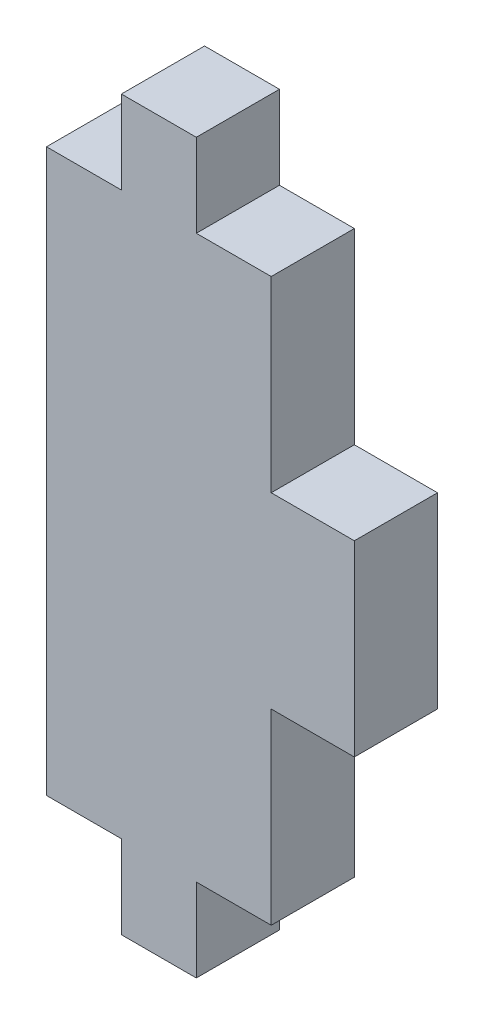
ISO-10303-21;
HEADER;
FILE_DESCRIPTION(('STEP AP214'),'2;1');
FILE_NAME('part.step','',(''),(''),'','','');
FILE_SCHEMA(('AUTOMOTIVE_DESIGN { 1 0 10303 214 1 1 1 1 }'));
ENDSEC;
DATA;
#1=APPLICATION_CONTEXT('core data for automotive mechanical design processes');
#2=APPLICATION_PROTOCOL_DEFINITION('international standard','automotive_design',2000,#1);
#3=PRODUCT_CONTEXT('',#1,'mechanical');
#4=PRODUCT('Part','Part','',(#3));
#5=PRODUCT_RELATED_PRODUCT_CATEGORY('part','',(#4));
#6=PRODUCT_DEFINITION_FORMATION('','',#4);
#7=PRODUCT_DEFINITION_CONTEXT('part definition',#1,'design');
#8=PRODUCT_DEFINITION('design','',#6,#7);
#9=PRODUCT_DEFINITION_SHAPE('','',#8);
#10=(LENGTH_UNIT() NAMED_UNIT(*) SI_UNIT(.MILLI.,.METRE.));
#11=(NAMED_UNIT(*) PLANE_ANGLE_UNIT() SI_UNIT($,.RADIAN.));
#12=(NAMED_UNIT(*) SI_UNIT($,.STERADIAN.) SOLID_ANGLE_UNIT());
#13=UNCERTAINTY_MEASURE_WITH_UNIT(LENGTH_MEASURE(1.E-05),#10,'distance_accuracy_value','');
#14=(GEOMETRIC_REPRESENTATION_CONTEXT(3) GLOBAL_UNCERTAINTY_ASSIGNED_CONTEXT((#13)) GLOBAL_UNIT_ASSIGNED_CONTEXT((#10,
#11,#12)) REPRESENTATION_CONTEXT('',''));
#15=CARTESIAN_POINT('',(0.,0.,0.));
#16=DIRECTION('',(0.,0.,1.));
#17=DIRECTION('',(1.,0.,0.));
#18=AXIS2_PLACEMENT_3D('',#15,#16,#17);
#19=CARTESIAN_POINT('',(0.,0.,4.699));
#20=DIRECTION('',(1.,0.,0.));
#21=DIRECTION('',(0.,0.,-1.));
#22=AXIS2_PLACEMENT_3D('',#19,#20,#21);
#23=PLANE('',#22);
#24=DIRECTION('',(0.,-1.,0.));
#25=VECTOR('',#24,1.);
#26=CARTESIAN_POINT('',(0.,0.,0.));
#27=LINE('',#26,#25);
#28=CARTESIAN_POINT('',(0.,31.75,0.));
#29=VERTEX_POINT('',#28);
#30=CARTESIAN_POINT('',(0.,0.,0.));
#31=VERTEX_POINT('',#30);
#32=EDGE_CURVE('E177',#29,#31,#27,.T.);
#33=ORIENTED_EDGE('',*,*,#32,.T.);
#34=DIRECTION('',(0.,0.,-1.));
#35=VECTOR('',#34,1.);
#36=CARTESIAN_POINT('',(0.,0.,4.699));
#37=LINE('',#36,#35);
#38=CARTESIAN_POINT('',(0.,0.,4.699));
#39=VERTEX_POINT('',#38);
#40=EDGE_CURVE('E11',#39,#31,#37,.T.);
#41=ORIENTED_EDGE('',*,*,#40,.F.);
#42=DIRECTION('',(0.,-1.,0.));
#43=VECTOR('',#42,1.);
#44=CARTESIAN_POINT('',(0.,0.,4.699));
#45=LINE('',#44,#43);
#46=CARTESIAN_POINT('',(0.,31.75,4.699));
#47=VERTEX_POINT('',#46);
#48=EDGE_CURVE('E207',#47,#39,#45,.T.);
#49=ORIENTED_EDGE('',*,*,#48,.F.);
#50=DIRECTION('',(0.,0.,-1.));
#51=VECTOR('',#50,1.);
#52=CARTESIAN_POINT('',(0.,31.75,4.699));
#53=LINE('',#52,#51);
#54=EDGE_CURVE('E173',#47,#29,#53,.T.);
#55=ORIENTED_EDGE('',*,*,#54,.T.);
#56=EDGE_LOOP('',(#33,#41,#49,#55));
#57=FACE_BOUND('',#56,.T.);
#58=ADVANCED_FACE('F33',(#57),#23,.F.);
#59=CARTESIAN_POINT('',(0.,0.,4.699));
#60=DIRECTION('',(0.,1.,0.));
#61=DIRECTION('',(0.,0.,1.));
#62=AXIS2_PLACEMENT_3D('',#59,#60,#61);
#63=PLANE('',#62);
#64=DIRECTION('',(1.,0.,0.));
#65=VECTOR('',#64,1.);
#66=CARTESIAN_POINT('',(0.,0.,0.));
#67=LINE('',#66,#65);
#68=CARTESIAN_POINT('',(4.23333333333334,0.,0.));
#69=VERTEX_POINT('',#68);
#70=EDGE_CURVE('E180',#31,#69,#67,.T.);
#71=ORIENTED_EDGE('',*,*,#70,.T.);
#72=DIRECTION('',(0.,0.,-1.));
#73=VECTOR('',#72,1.);
#74=CARTESIAN_POINT('',(4.23333333333334,0.,4.699));
#75=LINE('',#74,#73);
#76=CARTESIAN_POINT('',(4.23333333333334,0.,4.699));
#77=VERTEX_POINT('',#76);
#78=EDGE_CURVE('E41',#77,#69,#75,.T.);
#79=ORIENTED_EDGE('',*,*,#78,.F.);
#80=DIRECTION('',(1.,0.,0.));
#81=VECTOR('',#80,1.);
#82=CARTESIAN_POINT('',(0.,0.,4.699));
#83=LINE('',#82,#81);
#84=EDGE_CURVE('E116',#39,#77,#83,.T.);
#85=ORIENTED_EDGE('',*,*,#84,.F.);
#86=ORIENTED_EDGE('',*,*,#40,.T.);
#87=EDGE_LOOP('',(#71,#79,#85,#86));
#88=FACE_BOUND('',#87,.T.);
#89=ADVANCED_FACE('F305',(#88),#63,.F.);
#90=CARTESIAN_POINT('',(4.23333333333334,0.,4.699));
#91=DIRECTION('',(1.,0.,0.));
#92=DIRECTION('',(0.,1.,0.));
#93=AXIS2_PLACEMENT_3D('',#90,#91,#92);
#94=PLANE('',#93);
#95=DIRECTION('',(0.,-1.,0.));
#96=VECTOR('',#95,1.);
#97=CARTESIAN_POINT('',(4.23333333333334,0.,0.));
#98=LINE('',#97,#96);
#99=CARTESIAN_POINT('',(4.23333333333333,-4.699,0.));
#100=VERTEX_POINT('',#99);
#101=EDGE_CURVE('E182',#69,#100,#98,.T.);
#102=ORIENTED_EDGE('',*,*,#101,.T.);
#103=DIRECTION('',(0.,0.,-1.));
#104=VECTOR('',#103,1.);
#105=CARTESIAN_POINT('',(4.23333333333333,-4.699,4.699));
#106=LINE('',#105,#104);
#107=CARTESIAN_POINT('',(4.23333333333333,-4.699,4.699));
#108=VERTEX_POINT('',#107);
#109=EDGE_CURVE('E238',#108,#100,#106,.T.);
#110=ORIENTED_EDGE('',*,*,#109,.F.);
#111=DIRECTION('',(0.,-1.,0.));
#112=VECTOR('',#111,1.);
#113=CARTESIAN_POINT('',(4.23333333333334,0.,4.699));
#114=LINE('',#113,#112);
#115=EDGE_CURVE('E246',#77,#108,#114,.T.);
#116=ORIENTED_EDGE('',*,*,#115,.F.);
#117=ORIENTED_EDGE('',*,*,#78,.T.);
#118=EDGE_LOOP('',(#102,#110,#116,#117));
#119=FACE_BOUND('',#118,.T.);
#120=ADVANCED_FACE('F244',(#119),#94,.F.);
#121=CARTESIAN_POINT('',(4.23333333333333,-4.699,4.699));
#122=DIRECTION('',(0.,1.,0.));
#123=DIRECTION('',(0.,0.,1.));
#124=AXIS2_PLACEMENT_3D('',#121,#122,#123);
#125=PLANE('',#124);
#126=DIRECTION('',(1.,0.,0.));
#127=VECTOR('',#126,1.);
#128=CARTESIAN_POINT('',(4.23333333333333,-4.699,0.));
#129=LINE('',#128,#127);
#130=CARTESIAN_POINT('',(8.46666666666666,-4.699,0.));
#131=VERTEX_POINT('',#130);
#132=EDGE_CURVE('E184',#100,#131,#129,.T.);
#133=ORIENTED_EDGE('',*,*,#132,.T.);
#134=DIRECTION('',(0.,0.,-1.));
#135=VECTOR('',#134,1.);
#136=CARTESIAN_POINT('',(8.46666666666666,-4.699,4.699));
#137=LINE('',#136,#135);
#138=CARTESIAN_POINT('',(8.46666666666666,-4.699,4.699));
#139=VERTEX_POINT('',#138);
#140=EDGE_CURVE('E235',#139,#131,#137,.T.);
#141=ORIENTED_EDGE('',*,*,#140,.F.);
#142=DIRECTION('',(1.,0.,0.));
#143=VECTOR('',#142,1.);
#144=CARTESIAN_POINT('',(4.23333333333333,-4.699,4.699));
#145=LINE('',#144,#143);
#146=EDGE_CURVE('E264',#108,#139,#145,.T.);
#147=ORIENTED_EDGE('',*,*,#146,.F.);
#148=ORIENTED_EDGE('',*,*,#109,.T.);
#149=EDGE_LOOP('',(#133,#141,#147,#148));
#150=FACE_BOUND('',#149,.T.);
#151=ADVANCED_FACE('F255',(#150),#125,.F.);
#152=CARTESIAN_POINT('',(8.46666666666666,0.,4.699));
#153=DIRECTION('',(-1.,0.,0.));
#154=DIRECTION('',(0.,0.,1.));
#155=AXIS2_PLACEMENT_3D('',#152,#153,#154);
#156=PLANE('',#155);
#157=DIRECTION('',(0.,1.,0.));
#158=VECTOR('',#157,1.);
#159=CARTESIAN_POINT('',(8.46666666666666,0.,0.));
#160=LINE('',#159,#158);
#161=CARTESIAN_POINT('',(8.46666666666666,0.,0.));
#162=VERTEX_POINT('',#161);
#163=EDGE_CURVE('E186',#131,#162,#160,.T.);
#164=ORIENTED_EDGE('',*,*,#163,.T.);
#165=DIRECTION('',(0.,0.,-1.));
#166=VECTOR('',#165,1.);
#167=CARTESIAN_POINT('',(8.46666666666666,0.,4.699));
#168=LINE('',#167,#166);
#169=CARTESIAN_POINT('',(8.46666666666666,0.,4.699));
#170=VERTEX_POINT('',#169);
#171=EDGE_CURVE('E232',#170,#162,#168,.T.);
#172=ORIENTED_EDGE('',*,*,#171,.F.);
#173=DIRECTION('',(0.,1.,0.));
#174=VECTOR('',#173,1.);
#175=CARTESIAN_POINT('',(8.46666666666666,0.,4.699));
#176=LINE('',#175,#174);
#177=EDGE_CURVE('E261',#139,#170,#176,.T.);
#178=ORIENTED_EDGE('',*,*,#177,.F.);
#179=ORIENTED_EDGE('',*,*,#140,.T.);
#180=EDGE_LOOP('',(#164,#172,#178,#179));
#181=FACE_BOUND('',#180,.T.);
#182=ADVANCED_FACE('F259',(#181),#156,.F.);
#183=CARTESIAN_POINT('',(8.46666666666666,0.,4.699));
#184=DIRECTION('',(0.,1.,0.));
#185=DIRECTION('',(0.,0.,1.));
#186=AXIS2_PLACEMENT_3D('',#183,#184,#185);
#187=PLANE('',#186);
#188=DIRECTION('',(1.,0.,0.));
#189=VECTOR('',#188,1.);
#190=CARTESIAN_POINT('',(8.46666666666666,0.,0.));
#191=LINE('',#190,#189);
#192=CARTESIAN_POINT('',(12.7,0.,0.));
#193=VERTEX_POINT('',#192);
#194=EDGE_CURVE('E188',#162,#193,#191,.T.);
#195=ORIENTED_EDGE('',*,*,#194,.T.);
#196=DIRECTION('',(0.,0.,-1.));
#197=VECTOR('',#196,1.);
#198=CARTESIAN_POINT('',(12.7,0.,4.699));
#199=LINE('',#198,#197);
#200=CARTESIAN_POINT('',(12.7,0.,4.699));
#201=VERTEX_POINT('',#200);
#202=EDGE_CURVE('E229',#201,#193,#199,.T.);
#203=ORIENTED_EDGE('',*,*,#202,.F.);
#204=DIRECTION('',(1.,0.,0.));
#205=VECTOR('',#204,1.);
#206=CARTESIAN_POINT('',(8.46666666666666,0.,4.699));
#207=LINE('',#206,#205);
#208=EDGE_CURVE('E263',#170,#201,#207,.T.);
#209=ORIENTED_EDGE('',*,*,#208,.F.);
#210=ORIENTED_EDGE('',*,*,#171,.T.);
#211=EDGE_LOOP('',(#195,#203,#209,#210));
#212=FACE_BOUND('',#211,.T.);
#213=ADVANCED_FACE('F318',(#212),#187,.F.);
#214=CARTESIAN_POINT('',(12.7,0.,4.699));
#215=DIRECTION('',(-1.,0.,0.));
#216=DIRECTION('',(0.,-1.,0.));
#217=AXIS2_PLACEMENT_3D('',#214,#215,#216);
#218=PLANE('',#217);
#219=DIRECTION('',(0.,1.,0.));
#220=VECTOR('',#219,1.);
#221=CARTESIAN_POINT('',(12.7,0.,0.));
#222=LINE('',#221,#220);
#223=CARTESIAN_POINT('',(12.7,10.5833333333333,0.));
#224=VERTEX_POINT('',#223);
#225=EDGE_CURVE('E190',#193,#224,#222,.T.);
#226=ORIENTED_EDGE('',*,*,#225,.T.);
#227=DIRECTION('',(0.,0.,-1.));
#228=VECTOR('',#227,1.);
#229=CARTESIAN_POINT('',(12.7,10.5833333333333,4.699));
#230=LINE('',#229,#228);
#231=CARTESIAN_POINT('',(12.7,10.5833333333333,4.699));
#232=VERTEX_POINT('',#231);
#233=EDGE_CURVE('E226',#232,#224,#230,.T.);
#234=ORIENTED_EDGE('',*,*,#233,.F.);
#235=DIRECTION('',(0.,1.,0.));
#236=VECTOR('',#235,1.);
#237=CARTESIAN_POINT('',(12.7,0.,4.699));
#238=LINE('',#237,#236);
#239=EDGE_CURVE('E266',#201,#232,#238,.T.);
#240=ORIENTED_EDGE('',*,*,#239,.F.);
#241=ORIENTED_EDGE('',*,*,#202,.T.);
#242=EDGE_LOOP('',(#226,#234,#240,#241));
#243=FACE_BOUND('',#242,.T.);
#244=ADVANCED_FACE('F321',(#243),#218,.F.);
#245=CARTESIAN_POINT('',(12.7,10.5833333333333,4.699));
#246=DIRECTION('',(0.,1.,0.));
#247=DIRECTION('',(-1.,0.,0.));
#248=AXIS2_PLACEMENT_3D('',#245,#246,#247);
#249=PLANE('',#248);
#250=DIRECTION('',(1.,0.,0.));
#251=VECTOR('',#250,1.);
#252=CARTESIAN_POINT('',(12.7,10.5833333333333,0.));
#253=LINE('',#252,#251);
#254=CARTESIAN_POINT('',(17.399,10.5833333333333,0.));
#255=VERTEX_POINT('',#254);
#256=EDGE_CURVE('E192',#224,#255,#253,.T.);
#257=ORIENTED_EDGE('',*,*,#256,.T.);
#258=DIRECTION('',(0.,0.,-1.));
#259=VECTOR('',#258,1.);
#260=CARTESIAN_POINT('',(17.399,10.5833333333333,4.699));
#261=LINE('',#260,#259);
#262=CARTESIAN_POINT('',(17.399,10.5833333333333,4.699));
#263=VERTEX_POINT('',#262);
#264=EDGE_CURVE('E223',#263,#255,#261,.T.);
#265=ORIENTED_EDGE('',*,*,#264,.F.);
#266=DIRECTION('',(1.,0.,0.));
#267=VECTOR('',#266,1.);
#268=CARTESIAN_POINT('',(12.7,10.5833333333333,4.699));
#269=LINE('',#268,#267);
#270=EDGE_CURVE('E272',#232,#263,#269,.T.);
#271=ORIENTED_EDGE('',*,*,#270,.F.);
#272=ORIENTED_EDGE('',*,*,#233,.T.);
#273=EDGE_LOOP('',(#257,#265,#271,#272));
#274=FACE_BOUND('',#273,.T.);
#275=ADVANCED_FACE('F325',(#274),#249,.F.);
#276=CARTESIAN_POINT('',(17.399,21.1666666666667,4.699));
#277=DIRECTION('',(-1.,0.,0.));
#278=DIRECTION('',(0.,-1.,0.));
#279=AXIS2_PLACEMENT_3D('',#276,#277,#278);
#280=PLANE('',#279);
#281=DIRECTION('',(0.,1.,0.));
#282=VECTOR('',#281,1.);
#283=CARTESIAN_POINT('',(17.399,21.1666666666667,0.));
#284=LINE('',#283,#282);
#285=CARTESIAN_POINT('',(17.399,21.1666666666667,0.));
#286=VERTEX_POINT('',#285);
#287=EDGE_CURVE('E194',#255,#286,#284,.T.);
#288=ORIENTED_EDGE('',*,*,#287,.T.);
#289=DIRECTION('',(0.,0.,-1.));
#290=VECTOR('',#289,1.);
#291=CARTESIAN_POINT('',(17.399,21.1666666666667,4.699));
#292=LINE('',#291,#290);
#293=CARTESIAN_POINT('',(17.399,21.1666666666667,4.699));
#294=VERTEX_POINT('',#293);
#295=EDGE_CURVE('E220',#294,#286,#292,.T.);
#296=ORIENTED_EDGE('',*,*,#295,.F.);
#297=DIRECTION('',(0.,1.,0.));
#298=VECTOR('',#297,1.);
#299=CARTESIAN_POINT('',(17.399,21.1666666666667,4.699));
#300=LINE('',#299,#298);
#301=EDGE_CURVE('E274',#263,#294,#300,.T.);
#302=ORIENTED_EDGE('',*,*,#301,.F.);
#303=ORIENTED_EDGE('',*,*,#264,.T.);
#304=EDGE_LOOP('',(#288,#296,#302,#303));
#305=FACE_BOUND('',#304,.T.);
#306=ADVANCED_FACE('F329',(#305),#280,.F.);
#307=CARTESIAN_POINT('',(12.7,21.1666666666667,4.699));
#308=DIRECTION('',(0.,-1.,0.));
#309=DIRECTION('',(0.,0.,-1.));
#310=AXIS2_PLACEMENT_3D('',#307,#308,#309);
#311=PLANE('',#310);
#312=DIRECTION('',(-1.,0.,0.));
#313=VECTOR('',#312,1.);
#314=CARTESIAN_POINT('',(12.7,21.1666666666667,0.));
#315=LINE('',#314,#313);
#316=CARTESIAN_POINT('',(12.7,21.1666666666667,0.));
#317=VERTEX_POINT('',#316);
#318=EDGE_CURVE('E196',#286,#317,#315,.T.);
#319=ORIENTED_EDGE('',*,*,#318,.T.);
#320=DIRECTION('',(0.,0.,-1.));
#321=VECTOR('',#320,1.);
#322=CARTESIAN_POINT('',(12.7,21.1666666666667,4.699));
#323=LINE('',#322,#321);
#324=CARTESIAN_POINT('',(12.7,21.1666666666667,4.699));
#325=VERTEX_POINT('',#324);
#326=EDGE_CURVE('E217',#325,#317,#323,.T.);
#327=ORIENTED_EDGE('',*,*,#326,.F.);
#328=DIRECTION('',(-1.,0.,0.));
#329=VECTOR('',#328,1.);
#330=CARTESIAN_POINT('',(12.7,21.1666666666667,4.699));
#331=LINE('',#330,#329);
#332=EDGE_CURVE('E276',#294,#325,#331,.T.);
#333=ORIENTED_EDGE('',*,*,#332,.F.);
#334=ORIENTED_EDGE('',*,*,#295,.T.);
#335=EDGE_LOOP('',(#319,#327,#333,#334));
#336=FACE_BOUND('',#335,.T.);
#337=ADVANCED_FACE('F333',(#336),#311,.F.);
#338=CARTESIAN_POINT('',(12.7,21.1666666666667,4.699));
#339=DIRECTION('',(-1.,0.,0.));
#340=DIRECTION('',(0.,0.,1.));
#341=AXIS2_PLACEMENT_3D('',#338,#339,#340);
#342=PLANE('',#341);
#343=DIRECTION('',(0.,1.,0.));
#344=VECTOR('',#343,1.);
#345=CARTESIAN_POINT('',(12.7,21.1666666666667,0.));
#346=LINE('',#345,#344);
#347=CARTESIAN_POINT('',(12.7,31.75,0.));
#348=VERTEX_POINT('',#347);
#349=EDGE_CURVE('E198',#317,#348,#346,.T.);
#350=ORIENTED_EDGE('',*,*,#349,.T.);
#351=DIRECTION('',(0.,0.,-1.));
#352=VECTOR('',#351,1.);
#353=CARTESIAN_POINT('',(12.7,31.75,4.699));
#354=LINE('',#353,#352);
#355=CARTESIAN_POINT('',(12.7,31.75,4.699));
#356=VERTEX_POINT('',#355);
#357=EDGE_CURVE('E214',#356,#348,#354,.T.);
#358=ORIENTED_EDGE('',*,*,#357,.F.);
#359=DIRECTION('',(0.,1.,0.));
#360=VECTOR('',#359,1.);
#361=CARTESIAN_POINT('',(12.7,21.1666666666667,4.699));
#362=LINE('',#361,#360);
#363=EDGE_CURVE('E278',#325,#356,#362,.T.);
#364=ORIENTED_EDGE('',*,*,#363,.F.);
#365=ORIENTED_EDGE('',*,*,#326,.T.);
#366=EDGE_LOOP('',(#350,#358,#364,#365));
#367=FACE_BOUND('',#366,.T.);
#368=ADVANCED_FACE('F337',(#367),#342,.F.);
#369=CARTESIAN_POINT('',(8.46666666666667,31.75,4.699));
#370=DIRECTION('',(0.,-1.,0.));
#371=DIRECTION('',(0.,0.,-1.));
#372=AXIS2_PLACEMENT_3D('',#369,#370,#371);
#373=PLANE('',#372);
#374=DIRECTION('',(-1.,0.,0.));
#375=VECTOR('',#374,1.);
#376=CARTESIAN_POINT('',(8.46666666666667,31.75,0.));
#377=LINE('',#376,#375);
#378=CARTESIAN_POINT('',(8.46666666666667,31.75,0.));
#379=VERTEX_POINT('',#378);
#380=EDGE_CURVE('E200',#348,#379,#377,.T.);
#381=ORIENTED_EDGE('',*,*,#380,.T.);
#382=DIRECTION('',(0.,0.,-1.));
#383=VECTOR('',#382,1.);
#384=CARTESIAN_POINT('',(8.46666666666667,31.75,4.699));
#385=LINE('',#384,#383);
#386=CARTESIAN_POINT('',(8.46666666666667,31.75,4.699));
#387=VERTEX_POINT('',#386);
#388=EDGE_CURVE('E211',#387,#379,#385,.T.);
#389=ORIENTED_EDGE('',*,*,#388,.F.);
#390=DIRECTION('',(-1.,0.,0.));
#391=VECTOR('',#390,1.);
#392=CARTESIAN_POINT('',(8.46666666666667,31.75,4.699));
#393=LINE('',#392,#391);
#394=EDGE_CURVE('E280',#356,#387,#393,.T.);
#395=ORIENTED_EDGE('',*,*,#394,.F.);
#396=ORIENTED_EDGE('',*,*,#357,.T.);
#397=EDGE_LOOP('',(#381,#389,#395,#396));
#398=FACE_BOUND('',#397,.T.);
#399=ADVANCED_FACE('F286',(#398),#373,.F.);
#400=CARTESIAN_POINT('',(8.46666666666667,31.75,4.699));
#401=DIRECTION('',(-1.,0.,0.));
#402=DIRECTION('',(0.,-1.,0.));
#403=AXIS2_PLACEMENT_3D('',#400,#401,#402);
#404=PLANE('',#403);
#405=DIRECTION('',(0.,1.,0.));
#406=VECTOR('',#405,1.);
#407=CARTESIAN_POINT('',(8.46666666666667,31.75,0.));
#408=LINE('',#407,#406);
#409=CARTESIAN_POINT('',(8.46666666666666,36.449,0.));
#410=VERTEX_POINT('',#409);
#411=EDGE_CURVE('E202',#379,#410,#408,.T.);
#412=ORIENTED_EDGE('',*,*,#411,.T.);
#413=DIRECTION('',(0.,0.,-1.));
#414=VECTOR('',#413,1.);
#415=CARTESIAN_POINT('',(8.46666666666666,36.449,4.699));
#416=LINE('',#415,#414);
#417=CARTESIAN_POINT('',(8.46666666666666,36.449,4.699));
#418=VERTEX_POINT('',#417);
#419=EDGE_CURVE('E168',#418,#410,#416,.T.);
#420=ORIENTED_EDGE('',*,*,#419,.F.);
#421=DIRECTION('',(0.,1.,0.));
#422=VECTOR('',#421,1.);
#423=CARTESIAN_POINT('',(8.46666666666667,31.75,4.699));
#424=LINE('',#423,#422);
#425=EDGE_CURVE('E159',#387,#418,#424,.T.);
#426=ORIENTED_EDGE('',*,*,#425,.F.);
#427=ORIENTED_EDGE('',*,*,#388,.T.);
#428=EDGE_LOOP('',(#412,#420,#426,#427));
#429=FACE_BOUND('',#428,.T.);
#430=ADVANCED_FACE('F290',(#429),#404,.F.);
#431=CARTESIAN_POINT('',(4.23333333333333,36.449,4.699));
#432=DIRECTION('',(0.,-1.,0.));
#433=DIRECTION('',(0.,0.,-1.));
#434=AXIS2_PLACEMENT_3D('',#431,#432,#433);
#435=PLANE('',#434);
#436=DIRECTION('',(-1.,0.,0.));
#437=VECTOR('',#436,1.);
#438=CARTESIAN_POINT('',(4.23333333333333,36.449,0.));
#439=LINE('',#438,#437);
#440=CARTESIAN_POINT('',(4.23333333333333,36.449,0.));
#441=VERTEX_POINT('',#440);
#442=EDGE_CURVE('E167',#410,#441,#439,.T.);
#443=ORIENTED_EDGE('',*,*,#442,.T.);
#444=DIRECTION('',(0.,0.,-1.));
#445=VECTOR('',#444,1.);
#446=CARTESIAN_POINT('',(4.23333333333333,36.449,4.699));
#447=LINE('',#446,#445);
#448=CARTESIAN_POINT('',(4.23333333333333,36.449,4.699));
#449=VERTEX_POINT('',#448);
#450=EDGE_CURVE('E164',#449,#441,#447,.T.);
#451=ORIENTED_EDGE('',*,*,#450,.F.);
#452=DIRECTION('',(-1.,0.,0.));
#453=VECTOR('',#452,1.);
#454=CARTESIAN_POINT('',(4.23333333333333,36.449,4.699));
#455=LINE('',#454,#453);
#456=EDGE_CURVE('E153',#418,#449,#455,.T.);
#457=ORIENTED_EDGE('',*,*,#456,.F.);
#458=ORIENTED_EDGE('',*,*,#419,.T.);
#459=EDGE_LOOP('',(#443,#451,#457,#458));
#460=FACE_BOUND('',#459,.T.);
#461=ADVANCED_FACE('F165',(#460),#435,.F.);
#462=CARTESIAN_POINT('',(4.23333333333333,31.75,4.699));
#463=DIRECTION('',(1.,0.,0.));
#464=DIRECTION('',(0.,1.,0.));
#465=AXIS2_PLACEMENT_3D('',#462,#463,#464);
#466=PLANE('',#465);
#467=DIRECTION('',(0.,-1.,0.));
#468=VECTOR('',#467,1.);
#469=CARTESIAN_POINT('',(4.23333333333333,31.75,0.));
#470=LINE('',#469,#468);
#471=CARTESIAN_POINT('',(4.23333333333333,31.75,0.));
#472=VERTEX_POINT('',#471);
#473=EDGE_CURVE('E102',#441,#472,#470,.T.);
#474=ORIENTED_EDGE('',*,*,#473,.T.);
#475=DIRECTION('',(0.,0.,-1.));
#476=VECTOR('',#475,1.);
#477=CARTESIAN_POINT('',(4.23333333333333,31.75,4.699));
#478=LINE('',#477,#476);
#479=CARTESIAN_POINT('',(4.23333333333333,31.75,4.699));
#480=VERTEX_POINT('',#479);
#481=EDGE_CURVE('E169',#480,#472,#478,.T.);
#482=ORIENTED_EDGE('',*,*,#481,.F.);
#483=DIRECTION('',(0.,-1.,0.));
#484=VECTOR('',#483,1.);
#485=CARTESIAN_POINT('',(4.23333333333333,31.75,4.699));
#486=LINE('',#485,#484);
#487=EDGE_CURVE('E157',#449,#480,#486,.T.);
#488=ORIENTED_EDGE('',*,*,#487,.F.);
#489=ORIENTED_EDGE('',*,*,#450,.T.);
#490=EDGE_LOOP('',(#474,#482,#488,#489));
#491=FACE_BOUND('',#490,.T.);
#492=ADVANCED_FACE('F171',(#491),#466,.F.);
#493=CARTESIAN_POINT('',(0.,31.75,4.699));
#494=DIRECTION('',(0.,-1.,0.));
#495=DIRECTION('',(0.,0.,-1.));
#496=AXIS2_PLACEMENT_3D('',#493,#494,#495);
#497=PLANE('',#496);
#498=DIRECTION('',(-1.,0.,0.));
#499=VECTOR('',#498,1.);
#500=CARTESIAN_POINT('',(0.,31.75,0.));
#501=LINE('',#500,#499);
#502=EDGE_CURVE('E108',#472,#29,#501,.T.);
#503=ORIENTED_EDGE('',*,*,#502,.T.);
#504=ORIENTED_EDGE('',*,*,#54,.F.);
#505=DIRECTION('',(-1.,0.,0.));
#506=VECTOR('',#505,1.);
#507=CARTESIAN_POINT('',(0.,31.75,4.699));
#508=LINE('',#507,#506);
#509=EDGE_CURVE('E49',#480,#47,#508,.T.);
#510=ORIENTED_EDGE('',*,*,#509,.F.);
#511=ORIENTED_EDGE('',*,*,#481,.T.);
#512=EDGE_LOOP('',(#503,#504,#510,#511));
#513=FACE_BOUND('',#512,.T.);
#514=ADVANCED_FACE('F294',(#513),#497,.F.);
#515=CARTESIAN_POINT('',(0.,0.,4.699));
#516=DIRECTION('',(0.,0.,-1.));
#517=DIRECTION('',(-1.,0.,0.));
#518=AXIS2_PLACEMENT_3D('',#515,#516,#517);
#519=PLANE('',#518);
#520=ORIENTED_EDGE('',*,*,#48,.T.);
#521=ORIENTED_EDGE('',*,*,#84,.T.);
#522=ORIENTED_EDGE('',*,*,#115,.T.);
#523=ORIENTED_EDGE('',*,*,#146,.T.);
#524=ORIENTED_EDGE('',*,*,#177,.T.);
#525=ORIENTED_EDGE('',*,*,#208,.T.);
#526=ORIENTED_EDGE('',*,*,#239,.T.);
#527=ORIENTED_EDGE('',*,*,#270,.T.);
#528=ORIENTED_EDGE('',*,*,#301,.T.);
#529=ORIENTED_EDGE('',*,*,#332,.T.);
#530=ORIENTED_EDGE('',*,*,#363,.T.);
#531=ORIENTED_EDGE('',*,*,#394,.T.);
#532=ORIENTED_EDGE('',*,*,#425,.T.);
#533=ORIENTED_EDGE('',*,*,#456,.T.);
#534=ORIENTED_EDGE('',*,*,#487,.T.);
#535=ORIENTED_EDGE('',*,*,#509,.T.);
#536=EDGE_LOOP('',(#520,#521,#522,#523,#524,#525,#526,#527,#528,#529,#530,#531,#532,#533,#534,#535));
#537=FACE_BOUND('',#536,.T.);
#538=ADVANCED_FACE('F155',(#537),#519,.F.);
#539=CARTESIAN_POINT('',(0.,0.,0.));
#540=DIRECTION('',(0.,0.,-1.));
#541=DIRECTION('',(-1.,0.,0.));
#542=AXIS2_PLACEMENT_3D('',#539,#540,#541);
#543=PLANE('',#542);
#544=ORIENTED_EDGE('',*,*,#32,.F.);
#545=ORIENTED_EDGE('',*,*,#502,.F.);
#546=ORIENTED_EDGE('',*,*,#473,.F.);
#547=ORIENTED_EDGE('',*,*,#442,.F.);
#548=ORIENTED_EDGE('',*,*,#411,.F.);
#549=ORIENTED_EDGE('',*,*,#380,.F.);
#550=ORIENTED_EDGE('',*,*,#349,.F.);
#551=ORIENTED_EDGE('',*,*,#318,.F.);
#552=ORIENTED_EDGE('',*,*,#287,.F.);
#553=ORIENTED_EDGE('',*,*,#256,.F.);
#554=ORIENTED_EDGE('',*,*,#225,.F.);
#555=ORIENTED_EDGE('',*,*,#194,.F.);
#556=ORIENTED_EDGE('',*,*,#163,.F.);
#557=ORIENTED_EDGE('',*,*,#132,.F.);
#558=ORIENTED_EDGE('',*,*,#101,.F.);
#559=ORIENTED_EDGE('',*,*,#70,.F.);
#560=EDGE_LOOP('',(#544,#545,#546,#547,#548,#549,#550,#551,#552,#553,#554,#555,#556,#557,#558,#559));
#561=FACE_BOUND('',#560,.T.);
#562=ADVANCED_FACE('F250',(#561),#543,.T.);
#563=CLOSED_SHELL('',(#58,#89,#120,#151,#182,#213,#244,#275,#306,#337,#368,#399,#430,#461,#492,
#514,#538,#562));
#564=MANIFOLD_SOLID_BREP('B2',#563);
#565=ADVANCED_BREP_SHAPE_REPRESENTATION('',(#18,#564),#14);
#566=SHAPE_DEFINITION_REPRESENTATION(#9,#565);
ENDSEC;
END-ISO-10303-21;
